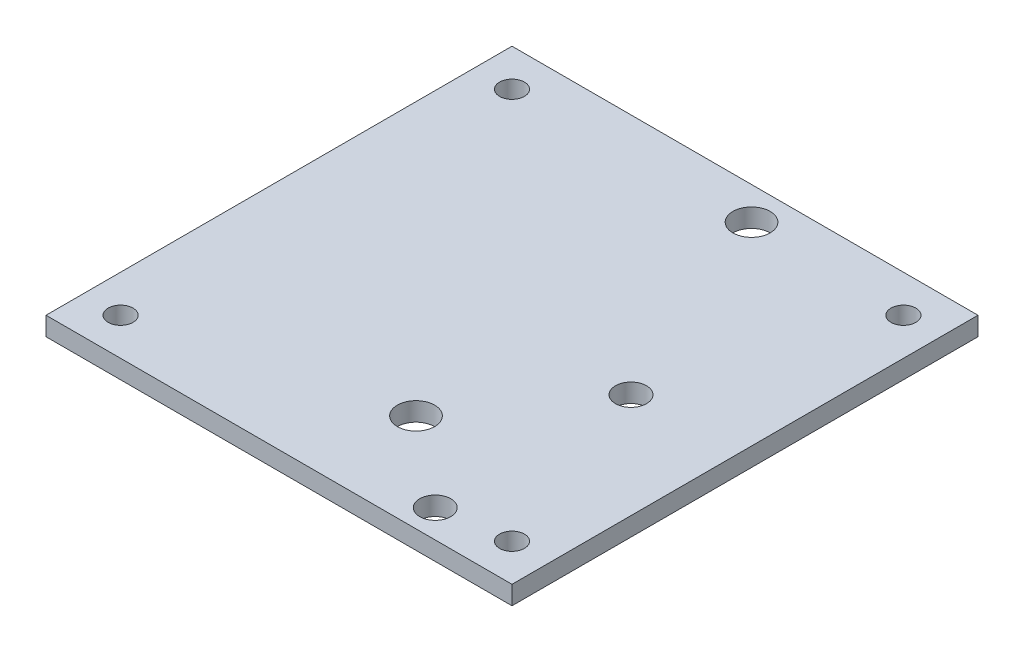
ISO-10303-21;
HEADER;
FILE_DESCRIPTION(('STEP AP214'),'2;1');
FILE_NAME('part.step','',(''),(''),'','','');
FILE_SCHEMA(('AUTOMOTIVE_DESIGN { 1 0 10303 214 1 1 1 1 }'));
ENDSEC;
DATA;
#1=APPLICATION_CONTEXT('core data for automotive mechanical design processes');
#2=APPLICATION_PROTOCOL_DEFINITION('international standard','automotive_design',2000,#1);
#3=PRODUCT_CONTEXT('',#1,'mechanical');
#4=PRODUCT('Part','Part','',(#3));
#5=PRODUCT_RELATED_PRODUCT_CATEGORY('part','',(#4));
#6=PRODUCT_DEFINITION_FORMATION('','',#4);
#7=PRODUCT_DEFINITION_CONTEXT('part definition',#1,'design');
#8=PRODUCT_DEFINITION('design','',#6,#7);
#9=PRODUCT_DEFINITION_SHAPE('','',#8);
#10=(LENGTH_UNIT() NAMED_UNIT(*) SI_UNIT(.MILLI.,.METRE.));
#11=(NAMED_UNIT(*) PLANE_ANGLE_UNIT() SI_UNIT($,.RADIAN.));
#12=(NAMED_UNIT(*) SI_UNIT($,.STERADIAN.) SOLID_ANGLE_UNIT());
#13=UNCERTAINTY_MEASURE_WITH_UNIT(LENGTH_MEASURE(1.E-05),#10,'distance_accuracy_value','');
#14=(GEOMETRIC_REPRESENTATION_CONTEXT(3) GLOBAL_UNCERTAINTY_ASSIGNED_CONTEXT((#13)) GLOBAL_UNIT_ASSIGNED_CONTEXT((#10,
#11,#12)) REPRESENTATION_CONTEXT('',''));
#15=CARTESIAN_POINT('',(0.,0.,0.));
#16=DIRECTION('',(0.,0.,1.));
#17=DIRECTION('',(1.,0.,0.));
#18=AXIS2_PLACEMENT_3D('',#15,#16,#17);
#19=CARTESIAN_POINT('',(0.,3.,0.));
#20=DIRECTION('',(0.,-1.,0.));
#21=DIRECTION('',(0.,0.,-1.));
#22=AXIS2_PLACEMENT_3D('',#19,#20,#21);
#23=PLANE('',#22);
#24=DIRECTION('',(0.,0.,-1.));
#25=VECTOR('',#24,1.);
#26=CARTESIAN_POINT('',(37.5,3.,37.5));
#27=LINE('',#26,#25);
#28=CARTESIAN_POINT('',(37.5,3.,37.5));
#29=VERTEX_POINT('',#28);
#30=CARTESIAN_POINT('',(37.5,3.,-37.5));
#31=VERTEX_POINT('',#30);
#32=EDGE_CURVE('E85',#29,#31,#27,.T.);
#33=ORIENTED_EDGE('',*,*,#32,.T.);
#34=DIRECTION('',(-1.,0.,0.));
#35=VECTOR('',#34,1.);
#36=CARTESIAN_POINT('',(-37.5,3.,-37.5));
#37=LINE('',#36,#35);
#38=CARTESIAN_POINT('',(-37.5,3.,-37.5));
#39=VERTEX_POINT('',#38);
#40=EDGE_CURVE('E80',#31,#39,#37,.T.);
#41=ORIENTED_EDGE('',*,*,#40,.T.);
#42=DIRECTION('',(0.,0.,1.));
#43=VECTOR('',#42,1.);
#44=CARTESIAN_POINT('',(-37.5,3.,37.5));
#45=LINE('',#44,#43);
#46=CARTESIAN_POINT('',(-37.5,3.,37.5));
#47=VERTEX_POINT('',#46);
#48=EDGE_CURVE('E83',#39,#47,#45,.T.);
#49=ORIENTED_EDGE('',*,*,#48,.T.);
#50=DIRECTION('',(1.,0.,0.));
#51=VECTOR('',#50,1.);
#52=CARTESIAN_POINT('',(-37.5,3.,37.5));
#53=LINE('',#52,#51);
#54=EDGE_CURVE('E50',#47,#29,#53,.T.);
#55=ORIENTED_EDGE('',*,*,#54,.T.);
#56=EDGE_LOOP('',(#33,#41,#49,#55));
#57=FACE_BOUND('',#56,.T.);
#58=CARTESIAN_POINT('',(31.5,3.,-31.5));
#59=DIRECTION('',(0.,1.,0.));
#60=DIRECTION('',(0.,0.,1.));
#61=AXIS2_PLACEMENT_3D('',#58,#59,#60);
#62=CIRCLE('',#61,2.);
#63=CARTESIAN_POINT('',(31.5,3.,-29.5));
#64=VERTEX_POINT('',#63);
#65=EDGE_CURVE('E100',#64,#64,#62,.T.);
#66=ORIENTED_EDGE('',*,*,#65,.F.);
#67=EDGE_LOOP('',(#66));
#68=FACE_BOUND('',#67,.T.);
#69=CARTESIAN_POINT('',(20.65,3.,33.));
#70=DIRECTION('',(0.,1.,0.));
#71=DIRECTION('',(0.,0.,1.));
#72=AXIS2_PLACEMENT_3D('',#69,#70,#71);
#73=CIRCLE('',#72,2.5);
#74=CARTESIAN_POINT('',(20.65,3.,35.5));
#75=VERTEX_POINT('',#74);
#76=EDGE_CURVE('E115',#75,#75,#73,.T.);
#77=ORIENTED_EDGE('',*,*,#76,.F.);
#78=EDGE_LOOP('',(#77));
#79=FACE_BOUND('',#78,.T.);
#80=CARTESIAN_POINT('',(31.5,3.,31.5));
#81=DIRECTION('',(0.,1.,0.));
#82=DIRECTION('',(0.,0.,1.));
#83=AXIS2_PLACEMENT_3D('',#80,#81,#82);
#84=CIRCLE('',#83,2.00000000000001);
#85=CARTESIAN_POINT('',(31.5,3.,33.5));
#86=VERTEX_POINT('',#85);
#87=EDGE_CURVE('E121',#86,#86,#84,.T.);
#88=ORIENTED_EDGE('',*,*,#87,.F.);
#89=EDGE_LOOP('',(#88));
#90=FACE_BOUND('',#89,.T.);
#91=CARTESIAN_POINT('',(-31.5,3.,31.5));
#92=DIRECTION('',(0.,1.,0.));
#93=DIRECTION('',(0.,0.,1.));
#94=AXIS2_PLACEMENT_3D('',#91,#92,#93);
#95=CIRCLE('',#94,2.00000000000001);
#96=CARTESIAN_POINT('',(-31.5,3.,33.5));
#97=VERTEX_POINT('',#96);
#98=EDGE_CURVE('E127',#97,#97,#95,.T.);
#99=ORIENTED_EDGE('',*,*,#98,.F.);
#100=EDGE_LOOP('',(#99));
#101=FACE_BOUND('',#100,.T.);
#102=CARTESIAN_POINT('',(-31.5,3.,-31.5));
#103=DIRECTION('',(0.,1.,0.));
#104=DIRECTION('',(0.,0.,1.));
#105=AXIS2_PLACEMENT_3D('',#102,#103,#104);
#106=CIRCLE('',#105,2.00000000000001);
#107=CARTESIAN_POINT('',(-31.5,3.,-29.5));
#108=VERTEX_POINT('',#107);
#109=EDGE_CURVE('E133',#108,#108,#106,.T.);
#110=ORIENTED_EDGE('',*,*,#109,.F.);
#111=EDGE_LOOP('',(#110));
#112=FACE_BOUND('',#111,.T.);
#113=CARTESIAN_POINT('',(20.65,3.,1.50000000000001));
#114=DIRECTION('',(0.,1.,0.));
#115=DIRECTION('',(0.,0.,1.));
#116=AXIS2_PLACEMENT_3D('',#113,#114,#115);
#117=CIRCLE('',#116,2.5);
#118=CARTESIAN_POINT('',(20.65,3.,4.00000000000001));
#119=VERTEX_POINT('',#118);
#120=EDGE_CURVE('E139',#119,#119,#117,.T.);
#121=ORIENTED_EDGE('',*,*,#120,.F.);
#122=EDGE_LOOP('',(#121));
#123=FACE_BOUND('',#122,.T.);
#124=CARTESIAN_POINT('',(6.29999999999997,3.,-32.25));
#125=DIRECTION('',(0.,1.,0.));
#126=DIRECTION('',(0.,0.,1.));
#127=AXIS2_PLACEMENT_3D('',#124,#125,#126);
#128=CIRCLE('',#127,3.);
#129=CARTESIAN_POINT('',(6.29999999999997,3.,-29.25));
#130=VERTEX_POINT('',#129);
#131=EDGE_CURVE('E145',#130,#130,#128,.T.);
#132=ORIENTED_EDGE('',*,*,#131,.F.);
#133=EDGE_LOOP('',(#132));
#134=FACE_BOUND('',#133,.T.);
#135=CARTESIAN_POINT('',(6.29999999999997,3.,21.75));
#136=DIRECTION('',(0.,1.,0.));
#137=DIRECTION('',(0.,0.,1.));
#138=AXIS2_PLACEMENT_3D('',#135,#136,#137);
#139=CIRCLE('',#138,3.);
#140=CARTESIAN_POINT('',(6.29999999999997,3.,24.75));
#141=VERTEX_POINT('',#140);
#142=EDGE_CURVE('E151',#141,#141,#139,.T.);
#143=ORIENTED_EDGE('',*,*,#142,.F.);
#144=EDGE_LOOP('',(#143));
#145=FACE_BOUND('',#144,.T.);
#146=ADVANCED_FACE('F33',(#57,#68,#79,#90,#101,#112,#123,#134,#145),#23,.F.);
#147=CARTESIAN_POINT('',(0.,0.,0.));
#148=DIRECTION('',(0.,-1.,0.));
#149=DIRECTION('',(0.,0.,-1.));
#150=AXIS2_PLACEMENT_3D('',#147,#148,#149);
#151=PLANE('',#150);
#152=CARTESIAN_POINT('',(6.29999999999997,0.,-32.25));
#153=DIRECTION('',(0.,1.,0.));
#154=DIRECTION('',(0.,0.,1.));
#155=AXIS2_PLACEMENT_3D('',#152,#153,#154);
#156=CIRCLE('',#155,3.);
#157=CARTESIAN_POINT('',(6.29999999999997,0.,-29.25));
#158=VERTEX_POINT('',#157);
#159=EDGE_CURVE('E148',#158,#158,#156,.T.);
#160=ORIENTED_EDGE('',*,*,#159,.T.);
#161=EDGE_LOOP('',(#160));
#162=FACE_BOUND('',#161,.T.);
#163=CARTESIAN_POINT('',(-31.5,0.,-31.5));
#164=DIRECTION('',(0.,1.,0.));
#165=DIRECTION('',(0.,0.,1.));
#166=AXIS2_PLACEMENT_3D('',#163,#164,#165);
#167=CIRCLE('',#166,2.00000000000001);
#168=CARTESIAN_POINT('',(-31.5,0.,-29.5));
#169=VERTEX_POINT('',#168);
#170=EDGE_CURVE('E136',#169,#169,#167,.T.);
#171=ORIENTED_EDGE('',*,*,#170,.T.);
#172=EDGE_LOOP('',(#171));
#173=FACE_BOUND('',#172,.T.);
#174=CARTESIAN_POINT('',(31.5,0.,31.5));
#175=DIRECTION('',(0.,1.,0.));
#176=DIRECTION('',(0.,0.,1.));
#177=AXIS2_PLACEMENT_3D('',#174,#175,#176);
#178=CIRCLE('',#177,2.00000000000001);
#179=CARTESIAN_POINT('',(31.5,0.,33.5));
#180=VERTEX_POINT('',#179);
#181=EDGE_CURVE('E124',#180,#180,#178,.T.);
#182=ORIENTED_EDGE('',*,*,#181,.T.);
#183=EDGE_LOOP('',(#182));
#184=FACE_BOUND('',#183,.T.);
#185=CARTESIAN_POINT('',(31.5,0.,-31.5));
#186=DIRECTION('',(0.,1.,0.));
#187=DIRECTION('',(0.,0.,1.));
#188=AXIS2_PLACEMENT_3D('',#185,#186,#187);
#189=CIRCLE('',#188,2.);
#190=CARTESIAN_POINT('',(31.5,0.,-29.5));
#191=VERTEX_POINT('',#190);
#192=EDGE_CURVE('E112',#191,#191,#189,.T.);
#193=ORIENTED_EDGE('',*,*,#192,.T.);
#194=EDGE_LOOP('',(#193));
#195=FACE_BOUND('',#194,.T.);
#196=DIRECTION('',(0.,0.,-1.));
#197=VECTOR('',#196,1.);
#198=CARTESIAN_POINT('',(37.5,0.,37.5));
#199=LINE('',#198,#197);
#200=CARTESIAN_POINT('',(37.5,0.,37.5));
#201=VERTEX_POINT('',#200);
#202=CARTESIAN_POINT('',(37.5,0.,-37.5));
#203=VERTEX_POINT('',#202);
#204=EDGE_CURVE('E97',#201,#203,#199,.T.);
#205=ORIENTED_EDGE('',*,*,#204,.F.);
#206=DIRECTION('',(1.,0.,0.));
#207=VECTOR('',#206,1.);
#208=CARTESIAN_POINT('',(-37.5,0.,37.5));
#209=LINE('',#208,#207);
#210=CARTESIAN_POINT('',(-37.5,0.,37.5));
#211=VERTEX_POINT('',#210);
#212=EDGE_CURVE('E73',#211,#201,#209,.T.);
#213=ORIENTED_EDGE('',*,*,#212,.F.);
#214=DIRECTION('',(0.,0.,1.));
#215=VECTOR('',#214,1.);
#216=CARTESIAN_POINT('',(-37.5,0.,37.5));
#217=LINE('',#216,#215);
#218=CARTESIAN_POINT('',(-37.5,0.,-37.5));
#219=VERTEX_POINT('',#218);
#220=EDGE_CURVE('E67',#219,#211,#217,.T.);
#221=ORIENTED_EDGE('',*,*,#220,.F.);
#222=DIRECTION('',(-1.,0.,0.));
#223=VECTOR('',#222,1.);
#224=CARTESIAN_POINT('',(-37.5,0.,-37.5));
#225=LINE('',#224,#223);
#226=EDGE_CURVE('E89',#203,#219,#225,.T.);
#227=ORIENTED_EDGE('',*,*,#226,.F.);
#228=EDGE_LOOP('',(#205,#213,#221,#227));
#229=FACE_BOUND('',#228,.T.);
#230=CARTESIAN_POINT('',(20.65,0.,33.));
#231=DIRECTION('',(0.,1.,0.));
#232=DIRECTION('',(0.,0.,1.));
#233=AXIS2_PLACEMENT_3D('',#230,#231,#232);
#234=CIRCLE('',#233,2.5);
#235=CARTESIAN_POINT('',(20.65,0.,35.5));
#236=VERTEX_POINT('',#235);
#237=EDGE_CURVE('E118',#236,#236,#234,.T.);
#238=ORIENTED_EDGE('',*,*,#237,.T.);
#239=EDGE_LOOP('',(#238));
#240=FACE_BOUND('',#239,.T.);
#241=CARTESIAN_POINT('',(-31.5,0.,31.5));
#242=DIRECTION('',(0.,1.,0.));
#243=DIRECTION('',(0.,0.,1.));
#244=AXIS2_PLACEMENT_3D('',#241,#242,#243);
#245=CIRCLE('',#244,2.00000000000001);
#246=CARTESIAN_POINT('',(-31.5,0.,33.5));
#247=VERTEX_POINT('',#246);
#248=EDGE_CURVE('E130',#247,#247,#245,.T.);
#249=ORIENTED_EDGE('',*,*,#248,.T.);
#250=EDGE_LOOP('',(#249));
#251=FACE_BOUND('',#250,.T.);
#252=CARTESIAN_POINT('',(20.65,0.,1.50000000000001));
#253=DIRECTION('',(0.,1.,0.));
#254=DIRECTION('',(0.,0.,1.));
#255=AXIS2_PLACEMENT_3D('',#252,#253,#254);
#256=CIRCLE('',#255,2.5);
#257=CARTESIAN_POINT('',(20.65,0.,4.00000000000001));
#258=VERTEX_POINT('',#257);
#259=EDGE_CURVE('E142',#258,#258,#256,.T.);
#260=ORIENTED_EDGE('',*,*,#259,.T.);
#261=EDGE_LOOP('',(#260));
#262=FACE_BOUND('',#261,.T.);
#263=CARTESIAN_POINT('',(6.29999999999997,0.,21.75));
#264=DIRECTION('',(0.,1.,0.));
#265=DIRECTION('',(0.,0.,1.));
#266=AXIS2_PLACEMENT_3D('',#263,#264,#265);
#267=CIRCLE('',#266,3.);
#268=CARTESIAN_POINT('',(6.29999999999997,0.,24.75));
#269=VERTEX_POINT('',#268);
#270=EDGE_CURVE('E154',#269,#269,#267,.T.);
#271=ORIENTED_EDGE('',*,*,#270,.T.);
#272=EDGE_LOOP('',(#271));
#273=FACE_BOUND('',#272,.T.);
#274=ADVANCED_FACE('F108',(#162,#173,#184,#195,#229,#240,#251,#262,#273),#151,.T.);
#275=CARTESIAN_POINT('',(37.5,3.,37.5));
#276=DIRECTION('',(-1.,0.,0.));
#277=DIRECTION('',(0.,0.,1.));
#278=AXIS2_PLACEMENT_3D('',#275,#276,#277);
#279=PLANE('',#278);
#280=ORIENTED_EDGE('',*,*,#204,.T.);
#281=DIRECTION('',(0.,-1.,0.));
#282=VECTOR('',#281,1.);
#283=CARTESIAN_POINT('',(37.5,3.,-37.5));
#284=LINE('',#283,#282);
#285=EDGE_CURVE('E11',#31,#203,#284,.T.);
#286=ORIENTED_EDGE('',*,*,#285,.F.);
#287=ORIENTED_EDGE('',*,*,#32,.F.);
#288=DIRECTION('',(0.,-1.,0.));
#289=VECTOR('',#288,1.);
#290=CARTESIAN_POINT('',(37.5,3.,37.5));
#291=LINE('',#290,#289);
#292=EDGE_CURVE('E93',#29,#201,#291,.T.);
#293=ORIENTED_EDGE('',*,*,#292,.T.);
#294=EDGE_LOOP('',(#280,#286,#287,#293));
#295=FACE_BOUND('',#294,.T.);
#296=ADVANCED_FACE('F35',(#295),#279,.F.);
#297=CARTESIAN_POINT('',(-37.5,3.,-37.5));
#298=DIRECTION('',(0.,0.,1.));
#299=DIRECTION('',(1.,0.,0.));
#300=AXIS2_PLACEMENT_3D('',#297,#298,#299);
#301=PLANE('',#300);
#302=ORIENTED_EDGE('',*,*,#226,.T.);
#303=DIRECTION('',(0.,-1.,0.));
#304=VECTOR('',#303,1.);
#305=CARTESIAN_POINT('',(-37.5,3.,-37.5));
#306=LINE('',#305,#304);
#307=EDGE_CURVE('E42',#39,#219,#306,.T.);
#308=ORIENTED_EDGE('',*,*,#307,.F.);
#309=ORIENTED_EDGE('',*,*,#40,.F.);
#310=ORIENTED_EDGE('',*,*,#285,.T.);
#311=EDGE_LOOP('',(#302,#308,#309,#310));
#312=FACE_BOUND('',#311,.T.);
#313=ADVANCED_FACE('F88',(#312),#301,.F.);
#314=CARTESIAN_POINT('',(-37.5,3.,37.5));
#315=DIRECTION('',(1.,0.,0.));
#316=DIRECTION('',(0.,0.,-1.));
#317=AXIS2_PLACEMENT_3D('',#314,#315,#316);
#318=PLANE('',#317);
#319=ORIENTED_EDGE('',*,*,#220,.T.);
#320=DIRECTION('',(0.,-1.,0.));
#321=VECTOR('',#320,1.);
#322=CARTESIAN_POINT('',(-37.5,3.,37.5));
#323=LINE('',#322,#321);
#324=EDGE_CURVE('E90',#47,#211,#323,.T.);
#325=ORIENTED_EDGE('',*,*,#324,.F.);
#326=ORIENTED_EDGE('',*,*,#48,.F.);
#327=ORIENTED_EDGE('',*,*,#307,.T.);
#328=EDGE_LOOP('',(#319,#325,#326,#327));
#329=FACE_BOUND('',#328,.T.);
#330=ADVANCED_FACE('F91',(#329),#318,.F.);
#331=CARTESIAN_POINT('',(-37.5,3.,37.5));
#332=DIRECTION('',(0.,0.,-1.));
#333=DIRECTION('',(-1.,0.,0.));
#334=AXIS2_PLACEMENT_3D('',#331,#332,#333);
#335=PLANE('',#334);
#336=ORIENTED_EDGE('',*,*,#212,.T.);
#337=ORIENTED_EDGE('',*,*,#292,.F.);
#338=ORIENTED_EDGE('',*,*,#54,.F.);
#339=ORIENTED_EDGE('',*,*,#324,.T.);
#340=EDGE_LOOP('',(#336,#337,#338,#339));
#341=FACE_BOUND('',#340,.T.);
#342=ADVANCED_FACE('F105',(#341),#335,.F.);
#343=CARTESIAN_POINT('',(31.5,3.,-31.5));
#344=DIRECTION('',(0.,-1.,0.));
#345=DIRECTION('',(0.,0.,-1.));
#346=AXIS2_PLACEMENT_3D('',#343,#344,#345);
#347=CYLINDRICAL_SURFACE('',#346,2.);
#348=ORIENTED_EDGE('',*,*,#65,.T.);
#349=EDGE_LOOP('',(#348));
#350=FACE_BOUND('',#349,.T.);
#351=ORIENTED_EDGE('',*,*,#192,.F.);
#352=EDGE_LOOP('',(#351));
#353=FACE_BOUND('',#352,.T.);
#354=ADVANCED_FACE('F171',(#350,#353),#347,.F.);
#355=CARTESIAN_POINT('',(20.65,3.,33.));
#356=DIRECTION('',(0.,-1.,0.));
#357=DIRECTION('',(0.,0.,-1.));
#358=AXIS2_PLACEMENT_3D('',#355,#356,#357);
#359=CYLINDRICAL_SURFACE('',#358,2.5);
#360=ORIENTED_EDGE('',*,*,#76,.T.);
#361=EDGE_LOOP('',(#360));
#362=FACE_BOUND('',#361,.T.);
#363=ORIENTED_EDGE('',*,*,#237,.F.);
#364=EDGE_LOOP('',(#363));
#365=FACE_BOUND('',#364,.T.);
#366=ADVANCED_FACE('F217',(#362,#365),#359,.F.);
#367=CARTESIAN_POINT('',(31.5,3.,31.5));
#368=DIRECTION('',(0.,-1.,0.));
#369=DIRECTION('',(0.,0.,-1.));
#370=AXIS2_PLACEMENT_3D('',#367,#368,#369);
#371=CYLINDRICAL_SURFACE('',#370,2.00000000000001);
#372=ORIENTED_EDGE('',*,*,#87,.T.);
#373=EDGE_LOOP('',(#372));
#374=FACE_BOUND('',#373,.T.);
#375=ORIENTED_EDGE('',*,*,#181,.F.);
#376=EDGE_LOOP('',(#375));
#377=FACE_BOUND('',#376,.T.);
#378=ADVANCED_FACE('F225',(#374,#377),#371,.F.);
#379=CARTESIAN_POINT('',(-31.5,3.,31.5));
#380=DIRECTION('',(0.,-1.,0.));
#381=DIRECTION('',(0.,0.,-1.));
#382=AXIS2_PLACEMENT_3D('',#379,#380,#381);
#383=CYLINDRICAL_SURFACE('',#382,2.00000000000001);
#384=ORIENTED_EDGE('',*,*,#98,.T.);
#385=EDGE_LOOP('',(#384));
#386=FACE_BOUND('',#385,.T.);
#387=ORIENTED_EDGE('',*,*,#248,.F.);
#388=EDGE_LOOP('',(#387));
#389=FACE_BOUND('',#388,.T.);
#390=ADVANCED_FACE('F233',(#386,#389),#383,.F.);
#391=CARTESIAN_POINT('',(-31.5,3.,-31.5));
#392=DIRECTION('',(0.,-1.,0.));
#393=DIRECTION('',(0.,0.,-1.));
#394=AXIS2_PLACEMENT_3D('',#391,#392,#393);
#395=CYLINDRICAL_SURFACE('',#394,2.00000000000001);
#396=ORIENTED_EDGE('',*,*,#109,.T.);
#397=EDGE_LOOP('',(#396));
#398=FACE_BOUND('',#397,.T.);
#399=ORIENTED_EDGE('',*,*,#170,.F.);
#400=EDGE_LOOP('',(#399));
#401=FACE_BOUND('',#400,.T.);
#402=ADVANCED_FACE('F242',(#398,#401),#395,.F.);
#403=CARTESIAN_POINT('',(20.65,3.,1.50000000000001));
#404=DIRECTION('',(0.,-1.,0.));
#405=DIRECTION('',(0.,0.,-1.));
#406=AXIS2_PLACEMENT_3D('',#403,#404,#405);
#407=CYLINDRICAL_SURFACE('',#406,2.5);
#408=ORIENTED_EDGE('',*,*,#120,.T.);
#409=EDGE_LOOP('',(#408));
#410=FACE_BOUND('',#409,.T.);
#411=ORIENTED_EDGE('',*,*,#259,.F.);
#412=EDGE_LOOP('',(#411));
#413=FACE_BOUND('',#412,.T.);
#414=ADVANCED_FACE('F251',(#410,#413),#407,.F.);
#415=CARTESIAN_POINT('',(6.29999999999997,3.,-32.25));
#416=DIRECTION('',(0.,-1.,0.));
#417=DIRECTION('',(0.,0.,-1.));
#418=AXIS2_PLACEMENT_3D('',#415,#416,#417);
#419=CYLINDRICAL_SURFACE('',#418,3.);
#420=ORIENTED_EDGE('',*,*,#131,.T.);
#421=EDGE_LOOP('',(#420));
#422=FACE_BOUND('',#421,.T.);
#423=ORIENTED_EDGE('',*,*,#159,.F.);
#424=EDGE_LOOP('',(#423));
#425=FACE_BOUND('',#424,.T.);
#426=ADVANCED_FACE('F260',(#422,#425),#419,.F.);
#427=CARTESIAN_POINT('',(6.29999999999997,3.,21.75));
#428=DIRECTION('',(0.,-1.,0.));
#429=DIRECTION('',(0.,0.,-1.));
#430=AXIS2_PLACEMENT_3D('',#427,#428,#429);
#431=CYLINDRICAL_SURFACE('',#430,3.);
#432=ORIENTED_EDGE('',*,*,#142,.T.);
#433=EDGE_LOOP('',(#432));
#434=FACE_BOUND('',#433,.T.);
#435=ORIENTED_EDGE('',*,*,#270,.F.);
#436=EDGE_LOOP('',(#435));
#437=FACE_BOUND('',#436,.T.);
#438=ADVANCED_FACE('F160',(#434,#437),#431,.F.);
#439=CLOSED_SHELL('',(#146,#274,#296,#313,#330,#342,#354,#366,#378,#390,#402,#414,#426,#438));
#440=MANIFOLD_SOLID_BREP('B2',#439);
#441=ADVANCED_BREP_SHAPE_REPRESENTATION('',(#18,#440),#14);
#442=SHAPE_DEFINITION_REPRESENTATION(#9,#441);
ENDSEC;
END-ISO-10303-21;
